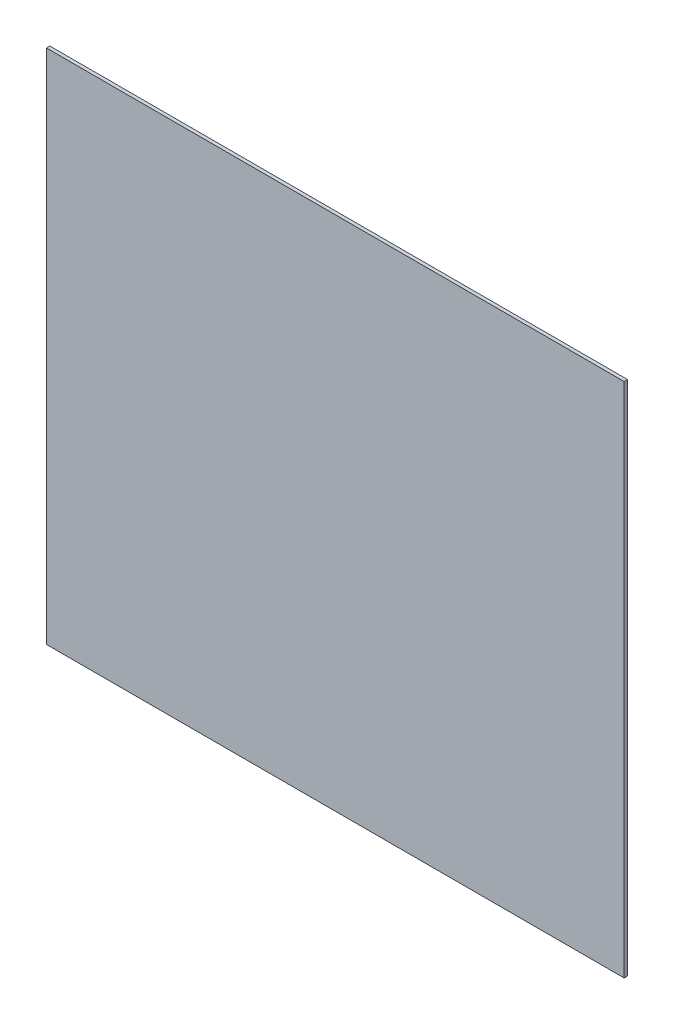
ISO-10303-21;
HEADER;
FILE_DESCRIPTION(('STEP AP214'),'2;1');
FILE_NAME('part.step','',(''),(''),'','','');
FILE_SCHEMA(('AUTOMOTIVE_DESIGN { 1 0 10303 214 1 1 1 1 }'));
ENDSEC;
DATA;
#1=APPLICATION_CONTEXT('core data for automotive mechanical design processes');
#2=APPLICATION_PROTOCOL_DEFINITION('international standard','automotive_design',2000,#1);
#3=PRODUCT_CONTEXT('',#1,'mechanical');
#4=PRODUCT('Part','Part','',(#3));
#5=PRODUCT_RELATED_PRODUCT_CATEGORY('part','',(#4));
#6=PRODUCT_DEFINITION_FORMATION('','',#4);
#7=PRODUCT_DEFINITION_CONTEXT('part definition',#1,'design');
#8=PRODUCT_DEFINITION('design','',#6,#7);
#9=PRODUCT_DEFINITION_SHAPE('','',#8);
#10=(LENGTH_UNIT() NAMED_UNIT(*) SI_UNIT(.MILLI.,.METRE.));
#11=(NAMED_UNIT(*) PLANE_ANGLE_UNIT() SI_UNIT($,.RADIAN.));
#12=(NAMED_UNIT(*) SI_UNIT($,.STERADIAN.) SOLID_ANGLE_UNIT());
#13=UNCERTAINTY_MEASURE_WITH_UNIT(LENGTH_MEASURE(1.E-05),#10,'distance_accuracy_value','');
#14=(GEOMETRIC_REPRESENTATION_CONTEXT(3) GLOBAL_UNCERTAINTY_ASSIGNED_CONTEXT((#13)) GLOBAL_UNIT_ASSIGNED_CONTEXT((#10,
#11,#12)) REPRESENTATION_CONTEXT('',''));
#15=CARTESIAN_POINT('',(0.,0.,0.));
#16=DIRECTION('',(0.,0.,1.));
#17=DIRECTION('',(1.,0.,0.));
#18=AXIS2_PLACEMENT_3D('',#15,#16,#17);
#19=CARTESIAN_POINT('',(0.,152.,2.));
#20=DIRECTION('',(0.,-1.,0.));
#21=DIRECTION('',(0.,0.,-1.));
#22=AXIS2_PLACEMENT_3D('',#19,#20,#21);
#23=PLANE('',#22);
#24=DIRECTION('',(-1.,0.,0.));
#25=VECTOR('',#24,1.);
#26=CARTESIAN_POINT('',(0.,152.,0.));
#27=LINE('',#26,#25);
#28=CARTESIAN_POINT('',(170.,152.,0.));
#29=VERTEX_POINT('',#28);
#30=CARTESIAN_POINT('',(-170.,152.,0.));
#31=VERTEX_POINT('',#30);
#32=EDGE_CURVE('E118',#29,#31,#27,.T.);
#33=ORIENTED_EDGE('',*,*,#32,.T.);
#34=DIRECTION('',(0.,0.,-1.));
#35=VECTOR('',#34,1.);
#36=CARTESIAN_POINT('',(-170.,152.,2.));
#37=LINE('',#36,#35);
#38=CARTESIAN_POINT('',(-170.,152.,2.));
#39=VERTEX_POINT('',#38);
#40=EDGE_CURVE('E11',#39,#31,#37,.T.);
#41=ORIENTED_EDGE('',*,*,#40,.F.);
#42=DIRECTION('',(-1.,0.,0.));
#43=VECTOR('',#42,1.);
#44=CARTESIAN_POINT('',(0.,152.,2.));
#45=LINE('',#44,#43);
#46=CARTESIAN_POINT('',(170.,152.,2.));
#47=VERTEX_POINT('',#46);
#48=EDGE_CURVE('E99',#47,#39,#45,.T.);
#49=ORIENTED_EDGE('',*,*,#48,.F.);
#50=DIRECTION('',(0.,0.,-1.));
#51=VECTOR('',#50,1.);
#52=CARTESIAN_POINT('',(170.,152.,2.));
#53=LINE('',#52,#51);
#54=EDGE_CURVE('E60',#47,#29,#53,.T.);
#55=ORIENTED_EDGE('',*,*,#54,.T.);
#56=EDGE_LOOP('',(#33,#41,#49,#55));
#57=FACE_BOUND('',#56,.T.);
#58=ADVANCED_FACE('F43',(#57),#23,.F.);
#59=CARTESIAN_POINT('',(-170.,0.,2.));
#60=DIRECTION('',(1.,0.,0.));
#61=DIRECTION('',(0.,1.,0.));
#62=AXIS2_PLACEMENT_3D('',#59,#60,#61);
#63=PLANE('',#62);
#64=DIRECTION('',(0.,-1.,0.));
#65=VECTOR('',#64,1.);
#66=CARTESIAN_POINT('',(-170.,0.,0.));
#67=LINE('',#66,#65);
#68=CARTESIAN_POINT('',(-170.,-152.,0.));
#69=VERTEX_POINT('',#68);
#70=EDGE_CURVE('E105',#31,#69,#67,.T.);
#71=ORIENTED_EDGE('',*,*,#70,.T.);
#72=DIRECTION('',(0.,0.,-1.));
#73=VECTOR('',#72,1.);
#74=CARTESIAN_POINT('',(-170.,-152.,2.));
#75=LINE('',#74,#73);
#76=CARTESIAN_POINT('',(-170.,-152.,2.));
#77=VERTEX_POINT('',#76);
#78=EDGE_CURVE('E52',#77,#69,#75,.T.);
#79=ORIENTED_EDGE('',*,*,#78,.F.);
#80=DIRECTION('',(0.,-1.,0.));
#81=VECTOR('',#80,1.);
#82=CARTESIAN_POINT('',(-170.,0.,2.));
#83=LINE('',#82,#81);
#84=EDGE_CURVE('E91',#39,#77,#83,.T.);
#85=ORIENTED_EDGE('',*,*,#84,.F.);
#86=ORIENTED_EDGE('',*,*,#40,.T.);
#87=EDGE_LOOP('',(#71,#79,#85,#86));
#88=FACE_BOUND('',#87,.T.);
#89=ADVANCED_FACE('F104',(#88),#63,.F.);
#90=CARTESIAN_POINT('',(0.,-152.,2.));
#91=DIRECTION('',(0.,-1.,0.));
#92=DIRECTION('',(1.,0.,0.));
#93=AXIS2_PLACEMENT_3D('',#90,#91,#92);
#94=PLANE('',#93);
#95=DIRECTION('',(-1.,0.,0.));
#96=VECTOR('',#95,1.);
#97=CARTESIAN_POINT('',(0.,-152.,0.));
#98=LINE('',#97,#96);
#99=CARTESIAN_POINT('',(170.,-152.,0.));
#100=VERTEX_POINT('',#99);
#101=EDGE_CURVE('E123',#100,#69,#98,.T.);
#102=ORIENTED_EDGE('',*,*,#101,.F.);
#103=DIRECTION('',(0.,0.,-1.));
#104=VECTOR('',#103,1.);
#105=CARTESIAN_POINT('',(170.,-152.,2.));
#106=LINE('',#105,#104);
#107=CARTESIAN_POINT('',(170.,-152.,2.));
#108=VERTEX_POINT('',#107);
#109=EDGE_CURVE('E79',#108,#100,#106,.T.);
#110=ORIENTED_EDGE('',*,*,#109,.F.);
#111=DIRECTION('',(-1.,0.,0.));
#112=VECTOR('',#111,1.);
#113=CARTESIAN_POINT('',(0.,-152.,2.));
#114=LINE('',#113,#112);
#115=EDGE_CURVE('E98',#108,#77,#114,.T.);
#116=ORIENTED_EDGE('',*,*,#115,.T.);
#117=ORIENTED_EDGE('',*,*,#78,.T.);
#118=EDGE_LOOP('',(#102,#110,#116,#117));
#119=FACE_BOUND('',#118,.T.);
#120=ADVANCED_FACE('F109',(#119),#94,.T.);
#121=CARTESIAN_POINT('',(170.,0.,2.));
#122=DIRECTION('',(1.,0.,0.));
#123=DIRECTION('',(0.,1.,0.));
#124=AXIS2_PLACEMENT_3D('',#121,#122,#123);
#125=PLANE('',#124);
#126=DIRECTION('',(0.,-1.,0.));
#127=VECTOR('',#126,1.);
#128=CARTESIAN_POINT('',(170.,0.,0.));
#129=LINE('',#128,#127);
#130=EDGE_CURVE('E125',#29,#100,#129,.T.);
#131=ORIENTED_EDGE('',*,*,#130,.F.);
#132=ORIENTED_EDGE('',*,*,#54,.F.);
#133=DIRECTION('',(0.,-1.,0.));
#134=VECTOR('',#133,1.);
#135=CARTESIAN_POINT('',(170.,0.,2.));
#136=LINE('',#135,#134);
#137=EDGE_CURVE('E111',#47,#108,#136,.T.);
#138=ORIENTED_EDGE('',*,*,#137,.T.);
#139=ORIENTED_EDGE('',*,*,#109,.T.);
#140=EDGE_LOOP('',(#131,#132,#138,#139));
#141=FACE_BOUND('',#140,.T.);
#142=ADVANCED_FACE('F134',(#141),#125,.T.);
#143=CARTESIAN_POINT('',(0.,0.,2.));
#144=DIRECTION('',(0.,0.,1.));
#145=DIRECTION('',(1.,0.,0.));
#146=AXIS2_PLACEMENT_3D('',#143,#144,#145);
#147=PLANE('',#146);
#148=ORIENTED_EDGE('',*,*,#48,.T.);
#149=ORIENTED_EDGE('',*,*,#84,.T.);
#150=ORIENTED_EDGE('',*,*,#115,.F.);
#151=ORIENTED_EDGE('',*,*,#137,.F.);
#152=EDGE_LOOP('',(#148,#149,#150,#151));
#153=FACE_BOUND('',#152,.T.);
#154=ADVANCED_FACE('F95',(#153),#147,.T.);
#155=CARTESIAN_POINT('',(0.,0.,0.));
#156=DIRECTION('',(0.,0.,1.));
#157=DIRECTION('',(1.,0.,0.));
#158=AXIS2_PLACEMENT_3D('',#155,#156,#157);
#159=PLANE('',#158);
#160=ORIENTED_EDGE('',*,*,#32,.F.);
#161=ORIENTED_EDGE('',*,*,#130,.T.);
#162=ORIENTED_EDGE('',*,*,#101,.T.);
#163=ORIENTED_EDGE('',*,*,#70,.F.);
#164=EDGE_LOOP('',(#160,#161,#162,#163));
#165=FACE_BOUND('',#164,.T.);
#166=ADVANCED_FACE('F133',(#165),#159,.F.);
#167=CLOSED_SHELL('',(#58,#89,#120,#142,#154,#166));
#168=MANIFOLD_SOLID_BREP('B2',#167);
#169=ADVANCED_BREP_SHAPE_REPRESENTATION('',(#18,#168),#14);
#170=SHAPE_DEFINITION_REPRESENTATION(#9,#169);
ENDSEC;
END-ISO-10303-21;
